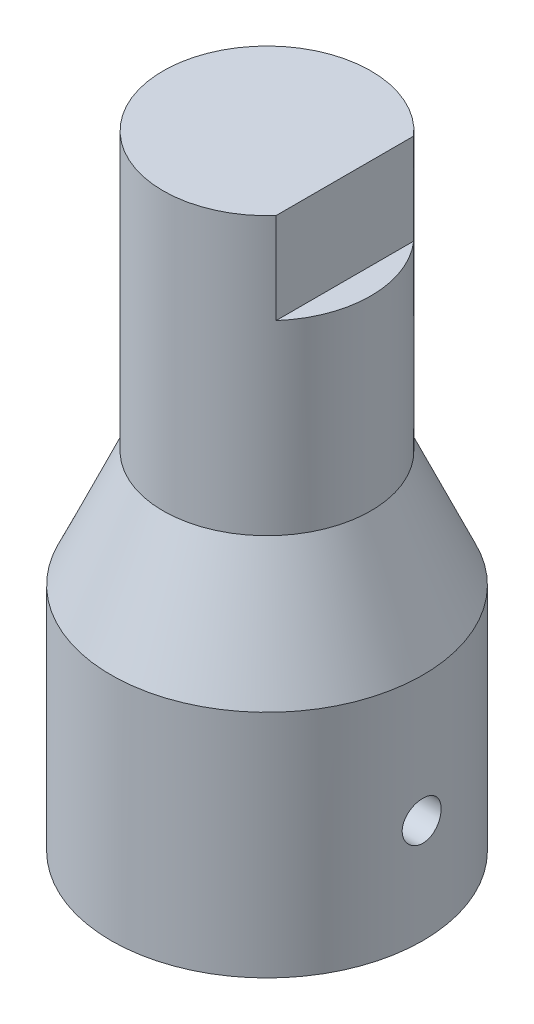
ISO-10303-21;
HEADER;
FILE_DESCRIPTION(('STEP AP214'),'2;1');
FILE_NAME('part.step','',(''),(''),'','','');
FILE_SCHEMA(('AUTOMOTIVE_DESIGN { 1 0 10303 214 1 1 1 1 }'));
ENDSEC;
DATA;
#1=APPLICATION_CONTEXT('core data for automotive mechanical design processes');
#2=APPLICATION_PROTOCOL_DEFINITION('international standard','automotive_design',2000,#1);
#3=PRODUCT_CONTEXT('',#1,'mechanical');
#4=PRODUCT('Part','Part','',(#3));
#5=PRODUCT_RELATED_PRODUCT_CATEGORY('part','',(#4));
#6=PRODUCT_DEFINITION_FORMATION('','',#4);
#7=PRODUCT_DEFINITION_CONTEXT('part definition',#1,'design');
#8=PRODUCT_DEFINITION('design','',#6,#7);
#9=PRODUCT_DEFINITION_SHAPE('','',#8);
#10=(LENGTH_UNIT() NAMED_UNIT(*) SI_UNIT(.MILLI.,.METRE.));
#11=(NAMED_UNIT(*) PLANE_ANGLE_UNIT() SI_UNIT($,.RADIAN.));
#12=(NAMED_UNIT(*) SI_UNIT($,.STERADIAN.) SOLID_ANGLE_UNIT());
#13=UNCERTAINTY_MEASURE_WITH_UNIT(LENGTH_MEASURE(1.E-05),#10,'distance_accuracy_value','');
#14=(GEOMETRIC_REPRESENTATION_CONTEXT(3) GLOBAL_UNCERTAINTY_ASSIGNED_CONTEXT((#13)) GLOBAL_UNIT_ASSIGNED_CONTEXT((#10,
#11,#12)) REPRESENTATION_CONTEXT('',''));
#15=CARTESIAN_POINT('',(0.,0.,0.));
#16=DIRECTION('',(0.,0.,1.));
#17=DIRECTION('',(1.,0.,0.));
#18=AXIS2_PLACEMENT_3D('',#15,#16,#17);
#19=CARTESIAN_POINT('',(0.,14.06,0.));
#20=DIRECTION('',(0.,-1.,0.));
#21=DIRECTION('',(0.,0.,-1.));
#22=AXIS2_PLACEMENT_3D('',#19,#20,#21);
#23=CYLINDRICAL_SURFACE('',#22,9.525);
#24=CARTESIAN_POINT('',(0.,14.06,0.));
#25=DIRECTION('',(0.,-1.,0.));
#26=DIRECTION('',(0.,0.,-1.));
#27=AXIS2_PLACEMENT_3D('',#24,#25,#26);
#28=CIRCLE('',#27,9.525);
#29=CARTESIAN_POINT('',(0.,14.06,-9.525));
#30=VERTEX_POINT('',#29);
#31=EDGE_CURVE('E83',#30,#30,#28,.F.);
#32=ORIENTED_EDGE('',*,*,#31,.F.);
#33=EDGE_LOOP('',(#32));
#34=FACE_BOUND('',#33,.T.);
#35=CARTESIAN_POINT('',(0.,0.,0.));
#36=DIRECTION('',(0.,1.,0.));
#37=DIRECTION('',(0.,0.,1.));
#38=AXIS2_PLACEMENT_3D('',#35,#36,#37);
#39=CIRCLE('',#38,9.525);
#40=CARTESIAN_POINT('',(0.,0.,9.525));
#41=VERTEX_POINT('',#40);
#42=EDGE_CURVE('E96',#41,#41,#39,.T.);
#43=ORIENTED_EDGE('',*,*,#42,.T.);
#44=EDGE_LOOP('',(#43));
#45=FACE_BOUND('',#44,.T.);
#46=CARTESIAN_POINT('',(9.45037168581215,6.35,1.19));
#47=CARTESIAN_POINT('',(9.45037264153151,6.28343763360096,1.18999716991653));
#48=CARTESIAN_POINT('',(9.45108251308956,6.21683365884784,1.1843964303129));
#49=CARTESIAN_POINT('',(9.45384422599999,6.08547928977974,1.16214251532668));
#50=CARTESIAN_POINT('',(9.45589746984964,6.02073090654836,1.14547778873659));
#51=CARTESIAN_POINT('',(9.46110981514661,5.89500853678741,1.10159483656561));
#52=CARTESIAN_POINT('',(9.46426816613176,5.83403202182239,1.07438377150283));
#53=CARTESIAN_POINT('',(9.47133395466148,5.7175222134488,1.01019588043544));
#54=CARTESIAN_POINT('',(9.47524126405582,5.661987991292,0.973220724703552));
#55=CARTESIAN_POINT('',(9.48338917829167,5.55761734378629,0.890332801063359));
#56=CARTESIAN_POINT('',(9.48763134988199,5.50881574535426,0.844376329040483));
#57=CARTESIAN_POINT('',(9.49595691130435,5.41959647319169,0.744924376498652));
#58=CARTESIAN_POINT('',(9.50004029323059,5.37917921646723,0.691428521220839));
#59=CARTESIAN_POINT('',(9.5076042146436,5.30775104258135,0.578197512107269));
#60=CARTESIAN_POINT('',(9.51108271819785,5.27677163849966,0.518442331675223));
#61=CARTESIAN_POINT('',(9.51702773167735,5.22530040739616,0.394526840092954));
#62=CARTESIAN_POINT('',(9.51949427912391,5.20480819152343,0.330366692373087));
#63=CARTESIAN_POINT('',(9.52312643380533,5.17499707510872,0.199818674007887));
#64=CARTESIAN_POINT('',(9.52429877975999,5.16562027914244,0.133444214479628));
#65=CARTESIAN_POINT('',(9.52523345022345,5.15812675008785,5.4171031885184E-05));
#66=CARTESIAN_POINT('',(9.52499583014668,5.16000957447439,-0.0669613875877963));
#67=CARTESIAN_POINT('',(9.52314279467513,5.17493543907906,-0.199337403060523));
#68=CARTESIAN_POINT('',(9.52153506646859,5.1879162139632,-0.264705003295682));
#69=CARTESIAN_POINT('',(9.51713109983186,5.2245721705004,-0.392326661691793));
#70=CARTESIAN_POINT('',(9.5143348388273,5.24824755528178,-0.454580660689544));
#71=CARTESIAN_POINT('',(9.50785476589063,5.30568689520441,-0.57440072392236));
#72=CARTESIAN_POINT('',(9.5041685883766,5.33947779791912,-0.631953736900307));
#73=CARTESIAN_POINT('',(9.49632108787332,5.41616937011639,-0.740595739392311));
#74=CARTESIAN_POINT('',(9.49215974311959,5.45907045695765,-0.791684432589693));
#75=CARTESIAN_POINT('',(9.4837940809287,5.55311333196171,-0.886313374417254));
#76=CARTESIAN_POINT('',(9.47958966407611,5.60430938396301,-0.929799704260077));
#77=CARTESIAN_POINT('',(9.47163976542179,5.71330250640203,-1.00757044992837));
#78=CARTESIAN_POINT('',(9.46789428505592,5.77109959749108,-1.04185483696445));
#79=CARTESIAN_POINT('',(9.461286366945,5.89170218000654,-1.10025156744196));
#80=CARTESIAN_POINT('',(9.45842430411225,5.95450978364658,-1.12435959374305));
#81=CARTESIAN_POINT('',(9.45391457914727,6.08332556338725,-1.16167145862918));
#82=CARTESIAN_POINT('',(9.45226685855337,6.14933358524813,-1.17487582214934));
#83=CARTESIAN_POINT('',(9.4503830576482,6.28220027581877,-1.18993413525669));
#84=CARTESIAN_POINT('',(9.45013754054481,6.34905021610411,-1.19186396418473));
#85=CARTESIAN_POINT('',(9.45106098640868,6.48212045912965,-1.18451863421254));
#86=CARTESIAN_POINT('',(9.45222991925946,6.54834077524554,-1.17524371388379));
#87=CARTESIAN_POINT('',(9.45584194377805,6.67804463948868,-1.14581605336035));
#88=CARTESIAN_POINT('',(9.45828073101195,6.74153665354108,-1.125700053228));
#89=CARTESIAN_POINT('',(9.46415418223574,6.86424645557599,-1.07519907196292));
#90=CARTESIAN_POINT('',(9.46758888117965,6.92346409344744,-1.04481373039573));
#91=CARTESIAN_POINT('',(9.47508975436793,7.03628748014224,-0.974450020430184));
#92=CARTESIAN_POINT('',(9.47915916429753,7.0898619761186,-0.934421890790981));
#93=CARTESIAN_POINT('',(9.48746077568779,7.18955941966134,-0.845979202945392));
#94=CARTESIAN_POINT('',(9.49169298346884,7.23568207755892,-0.797564318879548));
#95=CARTESIAN_POINT('',(9.4998723107226,7.31943313065488,-0.693390980417168));
#96=CARTESIAN_POINT('',(9.5038176697801,7.35701166665858,-0.637592283310463));
#97=CARTESIAN_POINT('',(9.51095243606812,7.42226276847941,-0.520430956263431));
#98=CARTESIAN_POINT('',(9.51414185852176,7.4499355337856,-0.459068438402256));
#99=CARTESIAN_POINT('',(9.51939757374525,7.49450722689759,-0.332687033687352));
#100=CARTESIAN_POINT('',(9.52146686860327,7.51143497401439,-0.267678440724219));
#101=CARTESIAN_POINT('',(9.52426163977849,7.53412986511567,-0.135714153998385));
#102=CARTESIAN_POINT('',(9.52498717662689,7.53989751182084,-0.0687585480792385));
#103=CARTESIAN_POINT('',(9.52501239888289,7.54009909151163,0.0647122895703891));
#104=CARTESIAN_POINT('',(9.52432175662993,7.53460990732446,0.131227416461206));
#105=CARTESIAN_POINT('',(9.52161144912067,7.51261647241154,0.26238193590744));
#106=CARTESIAN_POINT('',(9.51959178478192,7.49611222929047,0.327021329757808));
#107=CARTESIAN_POINT('',(9.51444936789292,7.45258130341164,0.452579463158118));
#108=CARTESIAN_POINT('',(9.51132700095355,7.42555829868751,0.513499494631467));
#109=CARTESIAN_POINT('',(9.50432492428026,7.36176490093249,0.629952236022893));
#110=CARTESIAN_POINT('',(9.50044520558124,7.32499439251424,0.685484882156463));
#111=CARTESIAN_POINT('',(9.4923298874484,7.24246531130851,0.789979263186505));
#112=CARTESIAN_POINT('',(9.48809212661981,7.1966495327557,0.838895652055997));
#113=CARTESIAN_POINT('',(9.47975569136095,7.0974492229981,0.928376018315304));
#114=CARTESIAN_POINT('',(9.47565705011555,7.04406290146226,0.968938014423616));
#115=CARTESIAN_POINT('',(9.46804605795317,6.93100081172117,1.04069195281877));
#116=CARTESIAN_POINT('',(9.46453602974224,6.87130157540942,1.07184714494874));
#117=CARTESIAN_POINT('',(9.45852691404486,6.74750807150617,1.12364570369548));
#118=CARTESIAN_POINT('',(9.4560267275397,6.68341867112672,1.14430050434002));
#119=CARTESIAN_POINT('',(9.45292749587681,6.57416460922818,1.16956651409533));
#120=CARTESIAN_POINT('',(9.45197383987563,6.52968909404729,1.17721805327143));
#121=CARTESIAN_POINT('',(9.45069561356315,6.44014874568561,1.18743573539382));
#122=CARTESIAN_POINT('',(9.45037103848582,6.39508391697216,1.19000191686767));
#123=CARTESIAN_POINT('',(9.45037168581215,6.35,1.19));
#124=B_SPLINE_CURVE_WITH_KNOTS('',3,(#46,#47,#48,#49,#50,#51,#52,#53,#54,#55,#56,#57,#58,#59,
#60,#61,#62,#63,#64,#65,#66,#67,#68,#69,#70,#71,#72,#73,#74,#75,#76,#77,#78,#79,#80,#81,#82,#83,
#84,#85,#86,#87,#88,#89,#90,#91,#92,#93,#94,#95,#96,#97,#98,#99,#100,#101,#102,#103,#104,#105,
#106,#107,#108,#109,#110,#111,#112,#113,#114,#115,#116,#117,#118,#119,#120,#121,#122,#123),
.UNSPECIFIED.,.T.,.F.,(4,2,2,2,2,2,2,2,2,2,2,2,2,2,2,2,2,2,2,2,2,2,2,2,2,2,2,2,2,2,2,2,2,2,2,2,
2,2,4),(0.,0.199522399972924,0.399253436900873,0.598849101788066,0.798410645373971,
0.998968609282526,1.19953654581048,1.40076702034379,1.60199003297955,1.80216029108681,
2.00232268216225,2.20136937178266,2.40041984215972,2.60000537137378,2.79960004603763,
3.00055746048545,3.20151550364546,3.40255871421423,3.60359224539375,3.80327121734763,
4.00294593781248,4.20194818383015,4.4009574151758,4.60101649566635,4.80108335100855,
5.00228933136802,5.20349125947837,5.40415123610588,5.60480217354306,5.80408725360614,
6.00337219608515,6.20258751827358,6.40180519880469,6.6023256823584,6.80289366562246,
7.00423537300968,7.20535736435751,7.34049858531239,7.47563878241023),.UNSPECIFIED.);
#125=CARTESIAN_POINT('',(9.45037168581215,6.35,1.19));
#126=VERTEX_POINT('',#125);
#127=EDGE_CURVE('E150',#126,#126,#124,.T.);
#128=ORIENTED_EDGE('',*,*,#127,.F.);
#129=EDGE_LOOP('',(#128));
#130=FACE_BOUND('',#129,.T.);
#131=ADVANCED_FACE('F43',(#34,#45,#130),#23,.T.);
#132=CARTESIAN_POINT('',(0.,0.,0.));
#133=DIRECTION('',(0.,1.,0.));
#134=DIRECTION('',(0.,0.,1.));
#135=AXIS2_PLACEMENT_3D('',#132,#133,#134);
#136=PLANE('',#135);
#137=CARTESIAN_POINT('',(-0.795000000000001,0.,-0.79));
#138=DIRECTION('',(0.,-1.,0.));
#139=DIRECTION('',(0.,0.,-1.));
#140=AXIS2_PLACEMENT_3D('',#137,#138,#139);
#141=CIRCLE('',#140,5.555);
#142=CARTESIAN_POINT('',(-0.795000000000001,0.,-6.345));
#143=VERTEX_POINT('',#142);
#144=EDGE_CURVE('E131',#143,#143,#141,.T.);
#145=ORIENTED_EDGE('',*,*,#144,.F.);
#146=EDGE_LOOP('',(#145));
#147=FACE_BOUND('',#146,.T.);
#148=ORIENTED_EDGE('',*,*,#42,.F.);
#149=EDGE_LOOP('',(#148));
#150=FACE_BOUND('',#149,.T.);
#151=ADVANCED_FACE('F118',(#147,#150),#136,.F.);
#152=CARTESIAN_POINT('',(0.,21.16,0.));
#153=DIRECTION('',(0.,-1.,0.));
#154=DIRECTION('',(0.,0.,-1.));
#155=AXIS2_PLACEMENT_3D('',#152,#153,#154);
#156=CONICAL_SURFACE('',#155,6.35,0.420508920904782);
#157=ORIENTED_EDGE('',*,*,#31,.T.);
#158=EDGE_LOOP('',(#157));
#159=FACE_BOUND('',#158,.T.);
#160=CARTESIAN_POINT('',(0.,21.16,0.));
#161=DIRECTION('',(0.,1.,0.));
#162=DIRECTION('',(0.,0.,1.));
#163=AXIS2_PLACEMENT_3D('',#160,#161,#162);
#164=CIRCLE('',#163,6.35);
#165=CARTESIAN_POINT('',(0.,21.16,6.35));
#166=VERTEX_POINT('',#165);
#167=EDGE_CURVE('E92',#166,#166,#164,.T.);
#168=ORIENTED_EDGE('',*,*,#167,.F.);
#169=EDGE_LOOP('',(#168));
#170=FACE_BOUND('',#169,.T.);
#171=ADVANCED_FACE('F109',(#159,#170),#156,.T.);
#172=CARTESIAN_POINT('',(0.,21.16,0.));
#173=DIRECTION('',(0.,1.,0.));
#174=DIRECTION('',(0.,0.,1.));
#175=AXIS2_PLACEMENT_3D('',#172,#173,#174);
#176=CYLINDRICAL_SURFACE('',#175,6.35);
#177=DIRECTION('',(0.,1.,0.));
#178=VECTOR('',#177,1.);
#179=CARTESIAN_POINT('',(4.76,21.16,4.20296324038172));
#180=LINE('',#179,#178);
#181=CARTESIAN_POINT('',(4.76,38.1,4.20296324038172));
#182=VERTEX_POINT('',#181);
#183=CARTESIAN_POINT('',(4.76,32.54,4.20296324038172));
#184=VERTEX_POINT('',#183);
#185=EDGE_CURVE('E77',#182,#184,#180,.F.);
#186=ORIENTED_EDGE('',*,*,#185,.F.);
#187=CARTESIAN_POINT('',(0.,38.1,0.));
#188=DIRECTION('',(0.,1.,0.));
#189=DIRECTION('',(0.,0.,1.));
#190=AXIS2_PLACEMENT_3D('',#187,#188,#189);
#191=CIRCLE('',#190,6.35);
#192=CARTESIAN_POINT('',(4.76,38.1,-4.20296324038172));
#193=VERTEX_POINT('',#192);
#194=EDGE_CURVE('E87',#193,#182,#191,.T.);
#195=ORIENTED_EDGE('',*,*,#194,.F.);
#196=DIRECTION('',(0.,1.,0.));
#197=VECTOR('',#196,1.);
#198=CARTESIAN_POINT('',(4.76,21.16,-4.20296324038172));
#199=LINE('',#198,#197);
#200=CARTESIAN_POINT('',(4.76,32.54,-4.20296324038172));
#201=VERTEX_POINT('',#200);
#202=EDGE_CURVE('E66',#201,#193,#199,.T.);
#203=ORIENTED_EDGE('',*,*,#202,.F.);
#204=CARTESIAN_POINT('',(0.,32.54,0.));
#205=DIRECTION('',(0.,-1.,0.));
#206=DIRECTION('',(0.,0.,-1.));
#207=AXIS2_PLACEMENT_3D('',#204,#205,#206);
#208=CIRCLE('',#207,6.35);
#209=EDGE_CURVE('E12',#184,#201,#208,.F.);
#210=ORIENTED_EDGE('',*,*,#209,.F.);
#211=EDGE_LOOP('',(#186,#195,#203,#210));
#212=FACE_BOUND('',#211,.T.);
#213=ORIENTED_EDGE('',*,*,#167,.T.);
#214=EDGE_LOOP('',(#213));
#215=FACE_BOUND('',#214,.T.);
#216=ADVANCED_FACE('F85',(#212,#215),#176,.T.);
#217=CARTESIAN_POINT('',(0.,38.1,0.));
#218=DIRECTION('',(0.,1.,0.));
#219=DIRECTION('',(0.,0.,1.));
#220=AXIS2_PLACEMENT_3D('',#217,#218,#219);
#221=PLANE('',#220);
#222=DIRECTION('',(0.,0.,1.));
#223=VECTOR('',#222,1.);
#224=CARTESIAN_POINT('',(4.76,38.1,0.));
#225=LINE('',#224,#223);
#226=EDGE_CURVE('E58',#193,#182,#225,.T.);
#227=ORIENTED_EDGE('',*,*,#226,.F.);
#228=ORIENTED_EDGE('',*,*,#194,.T.);
#229=EDGE_LOOP('',(#227,#228));
#230=FACE_BOUND('',#229,.T.);
#231=ADVANCED_FACE('F90',(#230),#221,.T.);
#232=CARTESIAN_POINT('',(6.35,32.54,-8.47));
#233=DIRECTION('',(0.,-1.,0.));
#234=DIRECTION('',(0.,0.,-1.));
#235=AXIS2_PLACEMENT_3D('',#232,#233,#234);
#236=PLANE('',#235);
#237=DIRECTION('',(0.,0.,1.));
#238=VECTOR('',#237,1.);
#239=CARTESIAN_POINT('',(4.76,32.54,-8.47));
#240=LINE('',#239,#238);
#241=EDGE_CURVE('E156',#201,#184,#240,.T.);
#242=ORIENTED_EDGE('',*,*,#241,.T.);
#243=ORIENTED_EDGE('',*,*,#209,.T.);
#244=EDGE_LOOP('',(#242,#243));
#245=FACE_BOUND('',#244,.T.);
#246=ADVANCED_FACE('F165',(#245),#236,.F.);
#247=CARTESIAN_POINT('',(4.76,38.1,-8.47));
#248=DIRECTION('',(-1.,0.,0.));
#249=DIRECTION('',(0.,-1.,0.));
#250=AXIS2_PLACEMENT_3D('',#247,#248,#249);
#251=PLANE('',#250);
#252=ORIENTED_EDGE('',*,*,#185,.T.);
#253=ORIENTED_EDGE('',*,*,#241,.F.);
#254=ORIENTED_EDGE('',*,*,#202,.T.);
#255=ORIENTED_EDGE('',*,*,#226,.T.);
#256=EDGE_LOOP('',(#252,#253,#254,#255));
#257=FACE_BOUND('',#256,.T.);
#258=ADVANCED_FACE('F76',(#257),#251,.F.);
#259=CARTESIAN_POINT('',(14.06,6.35,0.));
#260=DIRECTION('',(-1.,0.,0.));
#261=DIRECTION('',(0.,0.,1.));
#262=AXIS2_PLACEMENT_3D('',#259,#260,#261);
#263=CYLINDRICAL_SURFACE('',#262,1.19);
#264=CARTESIAN_POINT('',(4.39514691506897,6.35,1.19));
#265=CARTESIAN_POINT('',(4.39514869567024,6.28583827416043,1.18999752337068));
#266=CARTESIAN_POINT('',(4.39714398114926,6.22164880342982,1.18478925385734));
#267=CARTESIAN_POINT('',(4.4049430804347,6.09514521501501,1.16415799653331));
#268=CARTESIAN_POINT('',(4.41074989220538,6.03283261397137,1.14872696790053));
#269=CARTESIAN_POINT('',(4.42563261655886,5.91198219912204,1.10828330056213));
#270=CARTESIAN_POINT('',(4.4347012906058,5.85343636281963,1.0832918700021));
#271=CARTESIAN_POINT('',(4.45536708641701,5.74141582179302,1.02456208758364));
#272=CARTESIAN_POINT('',(4.46696438581402,5.68794147371334,0.990823121190357));
#273=CARTESIAN_POINT('',(4.49229728790691,5.58538233422991,0.914170416673225));
#274=CARTESIAN_POINT('',(4.50609588266132,5.53653154761348,0.870964695814204));
#275=CARTESIAN_POINT('',(4.53453333108699,5.44662328256908,0.777320068431062));
#276=CARTESIAN_POINT('',(4.54917240405058,5.40556785020181,0.726879268984447));
#277=CARTESIAN_POINT('',(4.5790865912313,5.33038094452289,0.617335324105894));
#278=CARTESIAN_POINT('',(4.59435754766611,5.29668971597649,0.557928020939723));
#279=CARTESIAN_POINT('',(4.62384493329786,5.23987290401204,0.43400882324117));
#280=CARTESIAN_POINT('',(4.63806132528932,5.21674769321927,0.369496748776059));
#281=CARTESIAN_POINT('',(4.66464212692148,5.18184699336994,0.23707854165977));
#282=CARTESIAN_POINT('',(4.67700612840949,5.17007400254569,0.169171665386544));
#283=CARTESIAN_POINT('',(4.69929227421118,5.15843922391316,0.0319513923290756));
#284=CARTESIAN_POINT('',(4.70921497718585,5.15857470845043,-0.0373616787276486));
#285=CARTESIAN_POINT('',(4.72602684749413,5.1707312904246,-0.172912818608512));
#286=CARTESIAN_POINT('',(4.73300714650146,5.1823508302674,-0.239175681234361));
#287=CARTESIAN_POINT('',(4.74440677406409,5.21666536390475,-0.368996601719719));
#288=CARTESIAN_POINT('',(4.74882642534802,5.23935896132726,-0.432554999497726));
#289=CARTESIAN_POINT('',(4.75529268553245,5.29457264550724,-0.55362448877911));
#290=CARTESIAN_POINT('',(4.75739086760409,5.32685806457261,-0.611240077670712));
#291=CARTESIAN_POINT('',(4.75983209082764,5.40052493745796,-0.720368791076221));
#292=CARTESIAN_POINT('',(4.76017509456102,5.44190658518014,-0.771881785466504));
#293=CARTESIAN_POINT('',(4.75966600505049,5.53278186325398,-0.867538879463345));
#294=CARTESIAN_POINT('',(4.75880932594322,5.58230597897288,-0.91165397716106));
#295=CARTESIAN_POINT('',(4.75650283512058,5.68797577147197,-0.99105612344396));
#296=CARTESIAN_POINT('',(4.75505299026307,5.74412181811675,-1.02634267857147));
#297=CARTESIAN_POINT('',(4.75211655106067,5.86212055112314,-1.08744414602191));
#298=CARTESIAN_POINT('',(4.75062972925467,5.92402805671628,-1.11315324851484));
#299=CARTESIAN_POINT('',(4.74811002576351,6.05128473749774,-1.15383339762376));
#300=CARTESIAN_POINT('',(4.7470771425515,6.11663390110896,-1.16880448035795));
#301=CARTESIAN_POINT('',(4.74576137488803,6.24900259278094,-1.18759129524224));
#302=CARTESIAN_POINT('',(4.74547936165406,6.31602397018561,-1.19139406958257));
#303=CARTESIAN_POINT('',(4.74574591995426,6.44975207138325,-1.18769683081515));
#304=CARTESIAN_POINT('',(4.74629448758899,6.51645879665198,-1.18019687077185));
#305=CARTESIAN_POINT('',(4.74806738854362,6.64752237359712,-1.15413847184923));
#306=CARTESIAN_POINT('',(4.74929032826273,6.71188378047452,-1.13560283210654));
#307=CARTESIAN_POINT('',(4.75205094860812,6.83658970307825,-1.08801870667277));
#308=CARTESIAN_POINT('',(4.75358863989216,6.89693408269286,-1.05896986497005));
#309=CARTESIAN_POINT('',(4.75646272031089,7.01204865987626,-0.991093732388285));
#310=CARTESIAN_POINT('',(4.75779861992326,7.06680520094464,-0.952243254190544));
#311=CARTESIAN_POINT('',(4.75964895753786,7.16902839109658,-0.865891828130765));
#312=CARTESIAN_POINT('',(4.76016340722631,7.21649514387846,-0.818391003342196));
#313=CARTESIAN_POINT('',(4.75974382275632,7.30268329858457,-0.716206604344497));
#314=CARTESIAN_POINT('',(4.75881296931729,7.34142369014708,-0.661539044428971));
#315=CARTESIAN_POINT('',(4.75496002494389,7.40917264818757,-0.546539867481574));
#316=CARTESIAN_POINT('',(4.75203814131298,7.43818222735576,-0.486208840686259));
#317=CARTESIAN_POINT('',(4.74386057633961,7.48539225810545,-0.362388273947183));
#318=CARTESIAN_POINT('',(4.73863154375622,7.50371074130071,-0.298941947594778));
#319=CARTESIAN_POINT('',(4.7256875571153,7.52960407449558,-0.170144366884523));
#320=CARTESIAN_POINT('',(4.7179726746429,7.5371792338372,-0.104793167430667));
#321=CARTESIAN_POINT('',(4.70015996595694,7.54151054140959,0.0258313999296897));
#322=CARTESIAN_POINT('',(4.69006583469644,7.5382833640065,0.0911047323542175));
#323=CARTESIAN_POINT('',(4.66781898501944,7.5213083208885,0.219905044218599));
#324=CARTESIAN_POINT('',(4.65566600453201,7.5075591150399,0.283431800138724));
#325=CARTESIAN_POINT('',(4.62952197000434,7.46959155969047,0.408657330656934));
#326=CARTESIAN_POINT('',(4.61549293686701,7.44512306523037,0.470272224791189));
#327=CARTESIAN_POINT('',(4.5865978952728,7.38642543973393,0.588453883301279));
#328=CARTESIAN_POINT('',(4.57173170493833,7.35219418105984,0.64501954374559));
#329=CARTESIAN_POINT('',(4.54156174943903,7.27356069306247,0.753505718351636));
#330=CARTESIAN_POINT('',(4.52625982950869,7.22885871117636,0.805209869536409));
#331=CARTESIAN_POINT('',(4.49679589752814,7.13106255747148,0.90038720532104));
#332=CARTESIAN_POINT('',(4.48263415266415,7.07796642717488,0.943858463851014));
#333=CARTESIAN_POINT('',(4.45659796331242,6.96478567126431,1.02119034236408));
#334=CARTESIAN_POINT('',(4.44472027247685,6.90471116197354,1.05506463552901));
#335=CARTESIAN_POINT('',(4.42430751868251,6.7791749072732,1.11204593656321));
#336=CARTESIAN_POINT('',(4.41576817542666,6.71372019141043,1.13516673939962));
#337=CARTESIAN_POINT('',(4.40468147728988,6.59833827449267,1.16486788919301));
#338=CARTESIAN_POINT('',(4.40112465475106,6.54921610480773,1.17427044472257));
#339=CARTESIAN_POINT('',(4.39635681060775,6.45006818138285,1.18683711662439));
#340=CARTESIAN_POINT('',(4.39514552630036,6.40004252946746,1.19000193163126));
#341=CARTESIAN_POINT('',(4.39514691506897,6.35,1.19));
#342=B_SPLINE_CURVE_WITH_KNOTS('',3,(#264,#265,#266,#267,#268,#269,#270,#271,#272,#273,#274,
#275,#276,#277,#278,#279,#280,#281,#282,#283,#284,#285,#286,#287,#288,#289,#290,#291,#292,#293,
#294,#295,#296,#297,#298,#299,#300,#301,#302,#303,#304,#305,#306,#307,#308,#309,#310,#311,#312,
#313,#314,#315,#316,#317,#318,#319,#320,#321,#322,#323,#324,#325,#326,#327,#328,#329,#330,#331,
#332,#333,#334,#335,#336,#337,#338,#339,#340,#341),.UNSPECIFIED.,.T.,.F.,(4,2,2,2,2,2,2,2,2,2,2,
2,2,2,2,2,2,2,2,2,2,2,2,2,2,2,2,2,2,2,2,2,2,2,2,2,2,2,4),(0.,0.192296283977589,
0.384744000551093,0.576767256843451,0.768804006875405,0.967908908741831,1.16706599800797,
1.3760253497523,1.58499207016934,1.79400476647053,2.00296958821947,2.20487721226126,
2.40675938354246,2.60406045476181,2.80136573221041,2.99942728363232,3.19749990292513,
3.39770009645587,3.59789961659358,3.79833132269607,3.99876208780807,4.19878020333795,
4.39880509277368,4.59930768385866,4.7998074225005,4.99986654072436,5.19990483223743,
5.39769071441064,5.59547090144433,5.7929459380648,5.99044613019602,6.19282347486639,
6.39524495817725,6.60438189902716,6.81356770679791,7.02245396290316,7.23107150797539,
7.38106857087362,7.53104883296153),.UNSPECIFIED.);
#343=CARTESIAN_POINT('',(4.39514691506897,6.35,1.19));
#344=VERTEX_POINT('',#343);
#345=EDGE_CURVE('E47',#344,#344,#342,.T.);
#346=ORIENTED_EDGE('',*,*,#345,.F.);
#347=EDGE_LOOP('',(#346));
#348=FACE_BOUND('',#347,.T.);
#349=ORIENTED_EDGE('',*,*,#127,.T.);
#350=EDGE_LOOP('',(#349));
#351=FACE_BOUND('',#350,.T.);
#352=ADVANCED_FACE('F157',(#348,#351),#263,.F.);
#353=CARTESIAN_POINT('',(-0.795000000000001,14.06,-0.79));
#354=DIRECTION('',(0.,-1.,0.));
#355=DIRECTION('',(0.,0.,-1.));
#356=AXIS2_PLACEMENT_3D('',#353,#354,#355);
#357=CYLINDRICAL_SURFACE('',#356,5.555);
#358=ORIENTED_EDGE('',*,*,#345,.T.);
#359=EDGE_LOOP('',(#358));
#360=FACE_BOUND('',#359,.T.);
#361=CARTESIAN_POINT('',(-0.795000000000001,14.06,-0.79));
#362=DIRECTION('',(0.,-1.,0.));
#363=DIRECTION('',(0.,0.,-1.));
#364=AXIS2_PLACEMENT_3D('',#361,#362,#363);
#365=CIRCLE('',#364,5.555);
#366=CARTESIAN_POINT('',(-0.795000000000001,14.06,-6.345));
#367=VERTEX_POINT('',#366);
#368=EDGE_CURVE('E230',#367,#367,#365,.T.);
#369=ORIENTED_EDGE('',*,*,#368,.F.);
#370=EDGE_LOOP('',(#369));
#371=FACE_BOUND('',#370,.T.);
#372=ORIENTED_EDGE('',*,*,#144,.T.);
#373=EDGE_LOOP('',(#372));
#374=FACE_BOUND('',#373,.T.);
#375=ADVANCED_FACE('F161',(#360,#371,#374),#357,.F.);
#376=CARTESIAN_POINT('',(-0.795000000000001,14.06,-0.79));
#377=DIRECTION('',(0.,-1.,0.));
#378=DIRECTION('',(0.,0.,-1.));
#379=AXIS2_PLACEMENT_3D('',#376,#377,#378);
#380=PLANE('',#379);
#381=ORIENTED_EDGE('',*,*,#368,.T.);
#382=EDGE_LOOP('',(#381));
#383=FACE_BOUND('',#382,.T.);
#384=ADVANCED_FACE('F214',(#383),#380,.T.);
#385=CLOSED_SHELL('',(#131,#151,#171,#216,#231,#246,#258,#352,#375,#384));
#386=MANIFOLD_SOLID_BREP('B2',#385);
#387=ADVANCED_BREP_SHAPE_REPRESENTATION('',(#18,#386),#14);
#388=SHAPE_DEFINITION_REPRESENTATION(#9,#387);
ENDSEC;
END-ISO-10303-21;
